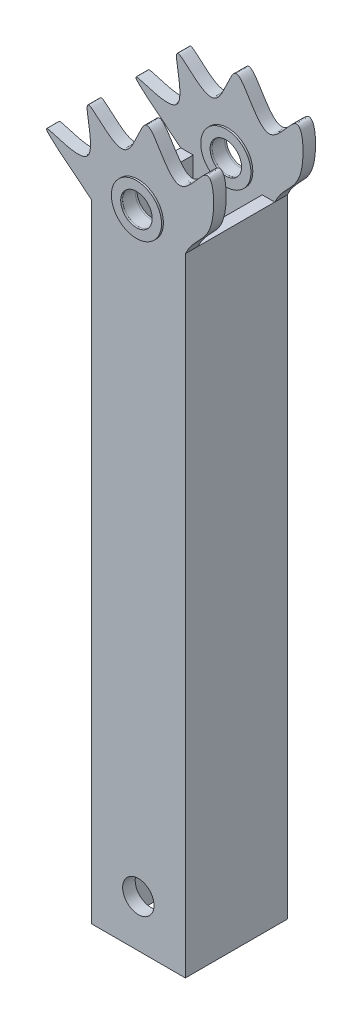
ISO-10303-21;
HEADER;
FILE_DESCRIPTION(('STEP AP214'),'2;1');
FILE_NAME('part.step','',(''),(''),'','','');
FILE_SCHEMA(('AUTOMOTIVE_DESIGN { 1 0 10303 214 1 1 1 1 }'));
ENDSEC;
DATA;
#1=APPLICATION_CONTEXT('core data for automotive mechanical design processes');
#2=APPLICATION_PROTOCOL_DEFINITION('international standard','automotive_design',2000,#1);
#3=PRODUCT_CONTEXT('',#1,'mechanical');
#4=PRODUCT('Part','Part','',(#3));
#5=PRODUCT_RELATED_PRODUCT_CATEGORY('part','',(#4));
#6=PRODUCT_DEFINITION_FORMATION('','',#4);
#7=PRODUCT_DEFINITION_CONTEXT('part definition',#1,'design');
#8=PRODUCT_DEFINITION('design','',#6,#7);
#9=PRODUCT_DEFINITION_SHAPE('','',#8);
#10=(LENGTH_UNIT() NAMED_UNIT(*) SI_UNIT(.MILLI.,.METRE.));
#11=(NAMED_UNIT(*) PLANE_ANGLE_UNIT() SI_UNIT($,.RADIAN.));
#12=(NAMED_UNIT(*) SI_UNIT($,.STERADIAN.) SOLID_ANGLE_UNIT());
#13=UNCERTAINTY_MEASURE_WITH_UNIT(LENGTH_MEASURE(1.E-05),#10,'distance_accuracy_value','');
#14=(GEOMETRIC_REPRESENTATION_CONTEXT(3) GLOBAL_UNCERTAINTY_ASSIGNED_CONTEXT((#13)) GLOBAL_UNIT_ASSIGNED_CONTEXT((#10,
#11,#12)) REPRESENTATION_CONTEXT('',''));
#15=CARTESIAN_POINT('',(0.,0.,0.));
#16=DIRECTION('',(0.,0.,1.));
#17=DIRECTION('',(1.,0.,0.));
#18=AXIS2_PLACEMENT_3D('',#15,#16,#17);
#19=CARTESIAN_POINT('',(0.,0.,-41.275));
#20=DIRECTION('',(0.,0.,1.));
#21=DIRECTION('',(-1.,0.,0.));
#22=AXIS2_PLACEMENT_3D('',#19,#20,#21);
#23=PLANE('',#22);
#24=CARTESIAN_POINT('',(0.,133.35,-41.275));
#25=DIRECTION('',(0.,0.,1.));
#26=DIRECTION('',(1.,0.,0.));
#27=AXIS2_PLACEMENT_3D('',#24,#25,#26);
#28=CIRCLE('',#27,6.34999999999999);
#29=CARTESIAN_POINT('',(6.34999999999998,133.35,-41.275));
#30=VERTEX_POINT('',#29);
#31=EDGE_CURVE('E165',#30,#30,#28,.T.);
#32=ORIENTED_EDGE('',*,*,#31,.T.);
#33=EDGE_LOOP('',(#32));
#34=FACE_BOUND('',#33,.T.);
#35=CARTESIAN_POINT('',(0.,133.35,-41.275));
#36=DIRECTION('',(0.,0.,-1.));
#37=DIRECTION('',(-1.,0.,0.));
#38=AXIS2_PLACEMENT_3D('',#35,#36,#37);
#39=CIRCLE('',#38,6.3754);
#40=CARTESIAN_POINT('',(-6.3754,133.35,-41.275));
#41=VERTEX_POINT('',#40);
#42=EDGE_CURVE('E294',#41,#41,#39,.T.);
#43=ORIENTED_EDGE('',*,*,#42,.T.);
#44=EDGE_LOOP('',(#43));
#45=FACE_BOUND('',#44,.T.);
#46=ADVANCED_FACE('F34',(#34,#45),#23,.F.);
#47=CARTESIAN_POINT('',(13.97,-127.,-36.195));
#48=DIRECTION('',(0.,0.,1.));
#49=DIRECTION('',(1.,0.,0.));
#50=AXIS2_PLACEMENT_3D('',#47,#48,#49);
#51=PLANE('',#50);
#52=CARTESIAN_POINT('',(0.,133.35,-36.195));
#53=DIRECTION('',(0.,0.,1.));
#54=DIRECTION('',(1.,0.,0.));
#55=AXIS2_PLACEMENT_3D('',#52,#53,#54);
#56=CIRCLE('',#55,6.34999999999999);
#57=CARTESIAN_POINT('',(6.34999999999998,133.35,-36.195));
#58=VERTEX_POINT('',#57);
#59=EDGE_CURVE('E162',#58,#58,#56,.F.);
#60=ORIENTED_EDGE('',*,*,#59,.T.);
#61=EDGE_LOOP('',(#60));
#62=FACE_BOUND('',#61,.T.);
#63=CARTESIAN_POINT('',(0.,133.35,-36.195));
#64=DIRECTION('',(0.,0.,1.));
#65=DIRECTION('',(1.,0.,0.));
#66=AXIS2_PLACEMENT_3D('',#63,#64,#65);
#67=CIRCLE('',#66,6.3754);
#68=CARTESIAN_POINT('',(6.37539999999999,133.35,-36.195));
#69=VERTEX_POINT('',#68);
#70=EDGE_CURVE('E42',#69,#69,#67,.F.);
#71=ORIENTED_EDGE('',*,*,#70,.F.);
#72=EDGE_LOOP('',(#71));
#73=FACE_BOUND('',#72,.T.);
#74=ADVANCED_FACE('F180',(#62,#73),#51,.T.);
#75=CARTESIAN_POINT('',(0.,0.,0.));
#76=DIRECTION('',(0.,0.,-1.));
#77=DIRECTION('',(-1.,0.,0.));
#78=AXIS2_PLACEMENT_3D('',#75,#76,#77);
#79=PLANE('',#78);
#80=CARTESIAN_POINT('',(0.,133.35,0.));
#81=DIRECTION('',(0.,0.,1.));
#82=DIRECTION('',(1.,0.,0.));
#83=AXIS2_PLACEMENT_3D('',#80,#81,#82);
#84=CIRCLE('',#83,6.34999999999999);
#85=CARTESIAN_POINT('',(6.34999999999998,133.35,0.));
#86=VERTEX_POINT('',#85);
#87=EDGE_CURVE('E157',#86,#86,#84,.T.);
#88=ORIENTED_EDGE('',*,*,#87,.F.);
#89=EDGE_LOOP('',(#88));
#90=FACE_BOUND('',#89,.T.);
#91=CARTESIAN_POINT('',(0.,133.35,0.));
#92=DIRECTION('',(0.,0.,1.));
#93=DIRECTION('',(1.,0.,0.));
#94=AXIS2_PLACEMENT_3D('',#91,#92,#93);
#95=CIRCLE('',#94,6.3754);
#96=CARTESIAN_POINT('',(6.37539999999999,133.35,0.));
#97=VERTEX_POINT('',#96);
#98=EDGE_CURVE('E308',#97,#97,#95,.T.);
#99=ORIENTED_EDGE('',*,*,#98,.T.);
#100=EDGE_LOOP('',(#99));
#101=FACE_BOUND('',#100,.T.);
#102=ADVANCED_FACE('F182',(#90,#101),#79,.F.);
#103=CARTESIAN_POINT('',(13.97,-127.,-5.08));
#104=DIRECTION('',(0.,0.,1.));
#105=DIRECTION('',(1.,0.,0.));
#106=AXIS2_PLACEMENT_3D('',#103,#104,#105);
#107=PLANE('',#106);
#108=CARTESIAN_POINT('',(0.,133.35,-5.08));
#109=DIRECTION('',(0.,0.,1.));
#110=DIRECTION('',(1.,0.,0.));
#111=AXIS2_PLACEMENT_3D('',#108,#109,#110);
#112=CIRCLE('',#111,6.34999999999999);
#113=CARTESIAN_POINT('',(6.34999999999998,133.35,-5.08));
#114=VERTEX_POINT('',#113);
#115=EDGE_CURVE('E153',#114,#114,#112,.T.);
#116=ORIENTED_EDGE('',*,*,#115,.T.);
#117=EDGE_LOOP('',(#116));
#118=FACE_BOUND('',#117,.T.);
#119=CARTESIAN_POINT('',(0.,133.35,-5.08));
#120=DIRECTION('',(0.,0.,-1.));
#121=DIRECTION('',(-1.,0.,0.));
#122=AXIS2_PLACEMENT_3D('',#119,#120,#121);
#123=CIRCLE('',#122,6.3754);
#124=CARTESIAN_POINT('',(-6.3754,133.35,-5.08));
#125=VERTEX_POINT('',#124);
#126=EDGE_CURVE('E318',#125,#125,#123,.T.);
#127=ORIENTED_EDGE('',*,*,#126,.T.);
#128=EDGE_LOOP('',(#127));
#129=FACE_BOUND('',#128,.T.);
#130=ADVANCED_FACE('F189',(#118,#129),#107,.F.);
#131=CARTESIAN_POINT('',(-19.05,127.,-20.6375));
#132=DIRECTION('',(0.,1.,0.));
#133=DIRECTION('',(0.,0.,1.));
#134=AXIS2_PLACEMENT_3D('',#131,#132,#133);
#135=PLANE('',#134);
#136=DIRECTION('',(0.,0.,1.));
#137=VECTOR('',#136,1.);
#138=CARTESIAN_POINT('',(19.05,127.,-20.6375));
#139=LINE('',#138,#137);
#140=CARTESIAN_POINT('',(19.05,127.,-36.195));
#141=VERTEX_POINT('',#140);
#142=CARTESIAN_POINT('',(19.05,127.,-5.08));
#143=VERTEX_POINT('',#142);
#144=EDGE_CURVE('E49',#141,#143,#139,.T.);
#145=ORIENTED_EDGE('',*,*,#144,.F.);
#146=DIRECTION('',(-1.,0.,0.));
#147=VECTOR('',#146,1.);
#148=CARTESIAN_POINT('',(-19.05,127.,-36.195));
#149=LINE('',#148,#147);
#150=CARTESIAN_POINT('',(13.97,127.,-36.195));
#151=VERTEX_POINT('',#150);
#152=EDGE_CURVE('E134',#141,#151,#149,.T.);
#153=ORIENTED_EDGE('',*,*,#152,.T.);
#154=DIRECTION('',(0.,0.,-1.));
#155=VECTOR('',#154,1.);
#156=CARTESIAN_POINT('',(13.97,127.,-20.6375));
#157=LINE('',#156,#155);
#158=CARTESIAN_POINT('',(13.97,127.,-5.08));
#159=VERTEX_POINT('',#158);
#160=EDGE_CURVE('E361',#159,#151,#157,.T.);
#161=ORIENTED_EDGE('',*,*,#160,.F.);
#162=DIRECTION('',(1.,0.,0.));
#163=VECTOR('',#162,1.);
#164=CARTESIAN_POINT('',(-19.05,127.,-5.08));
#165=LINE('',#164,#163);
#166=EDGE_CURVE('E387',#159,#143,#165,.T.);
#167=ORIENTED_EDGE('',*,*,#166,.T.);
#168=EDGE_LOOP('',(#145,#153,#161,#167));
#169=FACE_BOUND('',#168,.T.);
#170=ADVANCED_FACE('F325',(#169),#135,.T.);
#171=DIRECTION('',(0.,0.,1.));
#172=VECTOR('',#171,1.);
#173=CARTESIAN_POINT('',(-13.97,127.,-5.08));
#174=LINE('',#173,#172);
#175=CARTESIAN_POINT('',(-13.97,127.,-36.195));
#176=VERTEX_POINT('',#175);
#177=CARTESIAN_POINT('',(-13.97,127.,-5.08));
#178=VERTEX_POINT('',#177);
#179=EDGE_CURVE('E130',#176,#178,#174,.T.);
#180=ORIENTED_EDGE('',*,*,#179,.F.);
#181=CARTESIAN_POINT('',(-19.05,127.,-36.195));
#182=VERTEX_POINT('',#181);
#183=EDGE_CURVE('E126',#176,#182,#149,.T.);
#184=ORIENTED_EDGE('',*,*,#183,.T.);
#185=DIRECTION('',(0.,0.,1.));
#186=VECTOR('',#185,1.);
#187=CARTESIAN_POINT('',(-19.05,127.,-20.6375));
#188=LINE('',#187,#186);
#189=CARTESIAN_POINT('',(-19.05,127.,-5.08));
#190=VERTEX_POINT('',#189);
#191=EDGE_CURVE('E111',#182,#190,#188,.T.);
#192=ORIENTED_EDGE('',*,*,#191,.T.);
#193=EDGE_CURVE('E352',#190,#178,#165,.T.);
#194=ORIENTED_EDGE('',*,*,#193,.T.);
#195=EDGE_LOOP('',(#180,#184,#192,#194));
#196=FACE_BOUND('',#195,.T.);
#197=ADVANCED_FACE('F128',(#196),#135,.T.);
#198=CARTESIAN_POINT('',(-19.05,-127.,-20.6375));
#199=DIRECTION('',(0.,-1.,0.));
#200=DIRECTION('',(0.,0.,-1.));
#201=AXIS2_PLACEMENT_3D('',#198,#199,#200);
#202=PLANE('',#201);
#203=DIRECTION('',(1.,0.,0.));
#204=VECTOR('',#203,1.);
#205=CARTESIAN_POINT('',(13.97,-127.,-36.195));
#206=LINE('',#205,#204);
#207=CARTESIAN_POINT('',(-13.97,-127.,-36.195));
#208=VERTEX_POINT('',#207);
#209=CARTESIAN_POINT('',(13.97,-127.,-36.195));
#210=VERTEX_POINT('',#209);
#211=EDGE_CURVE('E398',#208,#210,#206,.T.);
#212=ORIENTED_EDGE('',*,*,#211,.F.);
#213=DIRECTION('',(0.,0.,1.));
#214=VECTOR('',#213,1.);
#215=CARTESIAN_POINT('',(-13.97,-127.,-5.08));
#216=LINE('',#215,#214);
#217=CARTESIAN_POINT('',(-13.97,-127.,-5.08));
#218=VERTEX_POINT('',#217);
#219=EDGE_CURVE('E371',#208,#218,#216,.T.);
#220=ORIENTED_EDGE('',*,*,#219,.T.);
#221=DIRECTION('',(1.,0.,0.));
#222=VECTOR('',#221,1.);
#223=CARTESIAN_POINT('',(13.97,-127.,-5.08));
#224=LINE('',#223,#222);
#225=CARTESIAN_POINT('',(13.97,-127.,-5.08));
#226=VERTEX_POINT('',#225);
#227=EDGE_CURVE('E355',#218,#226,#224,.T.);
#228=ORIENTED_EDGE('',*,*,#227,.T.);
#229=DIRECTION('',(0.,0.,-1.));
#230=VECTOR('',#229,1.);
#231=CARTESIAN_POINT('',(13.97,-127.,-20.6375));
#232=LINE('',#231,#230);
#233=EDGE_CURVE('E363',#226,#210,#232,.T.);
#234=ORIENTED_EDGE('',*,*,#233,.T.);
#235=EDGE_LOOP('',(#212,#220,#228,#234));
#236=FACE_BOUND('',#235,.T.);
#237=DIRECTION('',(1.,0.,0.));
#238=VECTOR('',#237,1.);
#239=CARTESIAN_POINT('',(-19.05,-127.,0.));
#240=LINE('',#239,#238);
#241=CARTESIAN_POINT('',(-19.05,-127.,0.));
#242=VERTEX_POINT('',#241);
#243=CARTESIAN_POINT('',(19.05,-127.,0.));
#244=VERTEX_POINT('',#243);
#245=EDGE_CURVE('E377',#242,#244,#240,.T.);
#246=ORIENTED_EDGE('',*,*,#245,.F.);
#247=DIRECTION('',(0.,0.,1.));
#248=VECTOR('',#247,1.);
#249=CARTESIAN_POINT('',(-19.05,-127.,-20.6375));
#250=LINE('',#249,#248);
#251=CARTESIAN_POINT('',(-19.05,-127.,-41.275));
#252=VERTEX_POINT('',#251);
#253=EDGE_CURVE('E148',#252,#242,#250,.T.);
#254=ORIENTED_EDGE('',*,*,#253,.F.);
#255=DIRECTION('',(1.,0.,0.));
#256=VECTOR('',#255,1.);
#257=CARTESIAN_POINT('',(-19.05,-127.,-41.275));
#258=LINE('',#257,#256);
#259=CARTESIAN_POINT('',(19.05,-127.,-41.275));
#260=VERTEX_POINT('',#259);
#261=EDGE_CURVE('E407',#252,#260,#258,.T.);
#262=ORIENTED_EDGE('',*,*,#261,.T.);
#263=DIRECTION('',(0.,0.,1.));
#264=VECTOR('',#263,1.);
#265=CARTESIAN_POINT('',(19.05,-127.,-20.6375));
#266=LINE('',#265,#264);
#267=EDGE_CURVE('E57',#260,#244,#266,.T.);
#268=ORIENTED_EDGE('',*,*,#267,.T.);
#269=EDGE_LOOP('',(#246,#254,#262,#268));
#270=FACE_BOUND('',#269,.T.);
#271=ADVANCED_FACE('F396',(#236,#270),#202,.T.);
#272=CARTESIAN_POINT('',(19.05,-127.,-20.6375));
#273=DIRECTION('',(1.,0.,0.));
#274=DIRECTION('',(0.,0.,-1.));
#275=AXIS2_PLACEMENT_3D('',#272,#273,#274);
#276=PLANE('',#275);
#277=CARTESIAN_POINT('',(19.05,127.,-41.275));
#278=VERTEX_POINT('',#277);
#279=EDGE_CURVE('E123',#278,#141,#139,.T.);
#280=ORIENTED_EDGE('',*,*,#279,.T.);
#281=ORIENTED_EDGE('',*,*,#144,.T.);
#282=DIRECTION('',(0.,0.,1.));
#283=VECTOR('',#282,1.);
#284=CARTESIAN_POINT('',(19.05,127.,-5.08));
#285=LINE('',#284,#283);
#286=CARTESIAN_POINT('',(19.05,127.,0.));
#287=VERTEX_POINT('',#286);
#288=EDGE_CURVE('E383',#143,#287,#285,.T.);
#289=ORIENTED_EDGE('',*,*,#288,.T.);
#290=DIRECTION('',(0.,1.,0.));
#291=VECTOR('',#290,1.);
#292=CARTESIAN_POINT('',(19.05,-127.,0.));
#293=LINE('',#292,#291);
#294=EDGE_CURVE('E357',#244,#287,#293,.T.);
#295=ORIENTED_EDGE('',*,*,#294,.F.);
#296=ORIENTED_EDGE('',*,*,#267,.F.);
#297=DIRECTION('',(0.,1.,0.));
#298=VECTOR('',#297,1.);
#299=CARTESIAN_POINT('',(19.05,-127.,-41.275));
#300=LINE('',#299,#298);
#301=EDGE_CURVE('E402',#260,#278,#300,.T.);
#302=ORIENTED_EDGE('',*,*,#301,.T.);
#303=EDGE_LOOP('',(#280,#281,#289,#295,#296,#302));
#304=FACE_BOUND('',#303,.T.);
#305=ADVANCED_FACE('F36',(#304),#276,.T.);
#306=CARTESIAN_POINT('',(-19.05,-127.,-20.6375));
#307=DIRECTION('',(-1.,0.,0.));
#308=DIRECTION('',(0.,0.,1.));
#309=AXIS2_PLACEMENT_3D('',#306,#307,#308);
#310=PLANE('',#309);
#311=ORIENTED_EDGE('',*,*,#253,.T.);
#312=DIRECTION('',(0.,-1.,0.));
#313=VECTOR('',#312,1.);
#314=CARTESIAN_POINT('',(-19.05,-127.,0.));
#315=LINE('',#314,#313);
#316=CARTESIAN_POINT('',(-19.05,127.,0.));
#317=VERTEX_POINT('',#316);
#318=EDGE_CURVE('E374',#317,#242,#315,.T.);
#319=ORIENTED_EDGE('',*,*,#318,.F.);
#320=DIRECTION('',(0.,0.,1.));
#321=VECTOR('',#320,1.);
#322=CARTESIAN_POINT('',(-19.05,127.,-5.08));
#323=LINE('',#322,#321);
#324=EDGE_CURVE('E120',#190,#317,#323,.T.);
#325=ORIENTED_EDGE('',*,*,#324,.F.);
#326=ORIENTED_EDGE('',*,*,#191,.F.);
#327=CARTESIAN_POINT('',(-19.05,127.,-41.275));
#328=VERTEX_POINT('',#327);
#329=EDGE_CURVE('E116',#328,#182,#188,.T.);
#330=ORIENTED_EDGE('',*,*,#329,.F.);
#331=DIRECTION('',(0.,-1.,0.));
#332=VECTOR('',#331,1.);
#333=CARTESIAN_POINT('',(-19.05,-127.,-41.275));
#334=LINE('',#333,#332);
#335=EDGE_CURVE('E409',#328,#252,#334,.T.);
#336=ORIENTED_EDGE('',*,*,#335,.T.);
#337=EDGE_LOOP('',(#311,#319,#325,#326,#330,#336));
#338=FACE_BOUND('',#337,.T.);
#339=ADVANCED_FACE('F113',(#338),#310,.T.);
#340=CARTESIAN_POINT('',(0.,133.35,0.));
#341=DIRECTION('',(0.,0.,-1.));
#342=DIRECTION('',(-1.,0.,0.));
#343=AXIS2_PLACEMENT_3D('',#340,#341,#342);
#344=CIRCLE('',#343,10.16);
#345=CARTESIAN_POINT('',(-10.16,133.35,0.));
#346=VERTEX_POINT('',#345);
#347=EDGE_CURVE('E173',#346,#346,#344,.F.);
#348=ORIENTED_EDGE('',*,*,#347,.F.);
#349=EDGE_LOOP('',(#348));
#350=FACE_BOUND('',#349,.T.);
#351=CARTESIAN_POINT('',(0.,-107.95,0.));
#352=DIRECTION('',(0.,0.,1.));
#353=DIRECTION('',(1.,0.,0.));
#354=AXIS2_PLACEMENT_3D('',#351,#352,#353);
#355=CIRCLE('',#354,6.34999999999999);
#356=CARTESIAN_POINT('',(6.34999999999999,-107.95,0.));
#357=VERTEX_POINT('',#356);
#358=EDGE_CURVE('E161',#357,#357,#355,.T.);
#359=ORIENTED_EDGE('',*,*,#358,.F.);
#360=EDGE_LOOP('',(#359));
#361=FACE_BOUND('',#360,.T.);
#362=ORIENTED_EDGE('',*,*,#294,.T.);
#363=CARTESIAN_POINT('',(19.05,127.,0.));
#364=CARTESIAN_POINT('',(22.264682919048,133.908235623245,0.));
#365=CARTESIAN_POINT('',(31.8390429124705,136.047979139782,0.));
#366=CARTESIAN_POINT('',(30.4669546194043,168.517170498395,0.));
#367=CARTESIAN_POINT('',(14.8126421317916,138.429098192106,0.));
#368=CARTESIAN_POINT('',(2.77585165558547,177.747781305733,0.));
#369=CARTESIAN_POINT('',(-3.38458125886248,140.10268819999,0.));
#370=CARTESIAN_POINT('',(-26.7121094582346,171.110128284464,0.));
#371=CARTESIAN_POINT('',(-8.76511536606956,122.45594985264,0.));
#372=CARTESIAN_POINT('',(-56.0753152623224,156.2498503925,0.));
#373=CARTESIAN_POINT('',(-19.05,127.,0.));
#374=B_SPLINE_CURVE_WITH_KNOTS('',3,(#363,#364,#365,#366,#367,#368,#369,#370,#371,#372,#373),
.UNSPECIFIED.,.F.,.F.,(4,1,1,1,1,1,1,1,4),(0.,0.117763915592875,0.232815074324997,
0.325131150893916,0.457169313957458,0.564335426334935,0.674077041064471,0.79253575626535,1.),.UNSPECIFIED.);
#375=EDGE_CURVE('E156',#287,#317,#374,.T.);
#376=ORIENTED_EDGE('',*,*,#375,.T.);
#377=ORIENTED_EDGE('',*,*,#318,.T.);
#378=ORIENTED_EDGE('',*,*,#245,.T.);
#379=EDGE_LOOP('',(#362,#376,#377,#378));
#380=FACE_BOUND('',#379,.T.);
#381=ADVANCED_FACE('F192',(#350,#361,#380),#79,.F.);
#382=CARTESIAN_POINT('',(0.,133.35,-5.08));
#383=DIRECTION('',(0.,0.,1.));
#384=DIRECTION('',(1.,0.,0.));
#385=AXIS2_PLACEMENT_3D('',#382,#383,#384);
#386=CIRCLE('',#385,10.16);
#387=CARTESIAN_POINT('',(10.16,133.35,-5.08));
#388=VERTEX_POINT('',#387);
#389=EDGE_CURVE('E170',#388,#388,#386,.F.);
#390=ORIENTED_EDGE('',*,*,#389,.F.);
#391=EDGE_LOOP('',(#390));
#392=FACE_BOUND('',#391,.T.);
#393=CARTESIAN_POINT('',(0.,-107.95,-5.08));
#394=DIRECTION('',(0.,0.,1.));
#395=DIRECTION('',(1.,0.,0.));
#396=AXIS2_PLACEMENT_3D('',#393,#394,#395);
#397=CIRCLE('',#396,6.34999999999999);
#398=CARTESIAN_POINT('',(6.34999999999999,-107.95,-5.08));
#399=VERTEX_POINT('',#398);
#400=EDGE_CURVE('E158',#399,#399,#397,.T.);
#401=ORIENTED_EDGE('',*,*,#400,.T.);
#402=EDGE_LOOP('',(#401));
#403=FACE_BOUND('',#402,.T.);
#404=DIRECTION('',(0.,1.,0.));
#405=VECTOR('',#404,1.);
#406=CARTESIAN_POINT('',(-13.97,-127.,-5.08));
#407=LINE('',#406,#405);
#408=EDGE_CURVE('E350',#218,#178,#407,.T.);
#409=ORIENTED_EDGE('',*,*,#408,.T.);
#410=ORIENTED_EDGE('',*,*,#193,.F.);
#411=CARTESIAN_POINT('',(19.05,127.,-5.08));
#412=CARTESIAN_POINT('',(22.264682919048,133.908235623245,-5.08));
#413=CARTESIAN_POINT('',(31.8390429124705,136.047979139782,-5.08));
#414=CARTESIAN_POINT('',(30.4669546194043,168.517170498395,-5.08));
#415=CARTESIAN_POINT('',(14.8126421317916,138.429098192106,-5.08));
#416=CARTESIAN_POINT('',(2.77585165558547,177.747781305733,-5.08));
#417=CARTESIAN_POINT('',(-3.38458125886248,140.10268819999,-5.08));
#418=CARTESIAN_POINT('',(-26.7121094582346,171.110128284464,-5.08));
#419=CARTESIAN_POINT('',(-8.76511536606956,122.45594985264,-5.08));
#420=CARTESIAN_POINT('',(-56.0753152623224,156.2498503925,-5.08));
#421=CARTESIAN_POINT('',(-19.05,127.,-5.08));
#422=B_SPLINE_CURVE_WITH_KNOTS('',3,(#411,#412,#413,#414,#415,#416,#417,#418,#419,#420,#421),
.UNSPECIFIED.,.F.,.F.,(4,1,1,1,1,1,1,1,4),(0.,0.117763915592875,0.232815074324997,
0.325131150893916,0.457169313957458,0.564335426334935,0.674077041064471,0.79253575626535,1.),.UNSPECIFIED.);
#423=EDGE_CURVE('E386',#143,#190,#422,.T.);
#424=ORIENTED_EDGE('',*,*,#423,.F.);
#425=ORIENTED_EDGE('',*,*,#166,.F.);
#426=DIRECTION('',(0.,1.,0.));
#427=VECTOR('',#426,1.);
#428=CARTESIAN_POINT('',(13.97,-127.,-5.08));
#429=LINE('',#428,#427);
#430=EDGE_CURVE('E358',#226,#159,#429,.T.);
#431=ORIENTED_EDGE('',*,*,#430,.F.);
#432=ORIENTED_EDGE('',*,*,#227,.F.);
#433=EDGE_LOOP('',(#409,#410,#424,#425,#431,#432));
#434=FACE_BOUND('',#433,.T.);
#435=ADVANCED_FACE('F328',(#392,#403,#434),#107,.F.);
#436=CARTESIAN_POINT('',(-13.97,-127.,-5.08));
#437=DIRECTION('',(-1.,0.,0.));
#438=DIRECTION('',(0.,0.,1.));
#439=AXIS2_PLACEMENT_3D('',#436,#437,#438);
#440=PLANE('',#439);
#441=ORIENTED_EDGE('',*,*,#179,.T.);
#442=ORIENTED_EDGE('',*,*,#408,.F.);
#443=ORIENTED_EDGE('',*,*,#219,.F.);
#444=DIRECTION('',(0.,1.,0.));
#445=VECTOR('',#444,1.);
#446=CARTESIAN_POINT('',(-13.97,-127.,-36.195));
#447=LINE('',#446,#445);
#448=EDGE_CURVE('E360',#208,#176,#447,.T.);
#449=ORIENTED_EDGE('',*,*,#448,.T.);
#450=EDGE_LOOP('',(#441,#442,#443,#449));
#451=FACE_BOUND('',#450,.T.);
#452=ADVANCED_FACE('F334',(#451),#440,.F.);
#453=CARTESIAN_POINT('',(13.97,-127.,-20.6375));
#454=DIRECTION('',(1.,0.,0.));
#455=DIRECTION('',(0.,0.,-1.));
#456=AXIS2_PLACEMENT_3D('',#453,#454,#455);
#457=PLANE('',#456);
#458=ORIENTED_EDGE('',*,*,#160,.T.);
#459=DIRECTION('',(0.,1.,0.));
#460=VECTOR('',#459,1.);
#461=CARTESIAN_POINT('',(13.97,-127.,-36.195));
#462=LINE('',#461,#460);
#463=EDGE_CURVE('E400',#210,#151,#462,.T.);
#464=ORIENTED_EDGE('',*,*,#463,.F.);
#465=ORIENTED_EDGE('',*,*,#233,.F.);
#466=ORIENTED_EDGE('',*,*,#430,.T.);
#467=EDGE_LOOP('',(#458,#464,#465,#466));
#468=FACE_BOUND('',#467,.T.);
#469=ADVANCED_FACE('F340',(#468),#457,.F.);
#470=DIRECTION('',(0.,0.,1.));
#471=VECTOR('',#470,1.);
#472=SURFACE_OF_LINEAR_EXTRUSION('',#422,#471);
#473=ORIENTED_EDGE('',*,*,#375,.F.);
#474=ORIENTED_EDGE('',*,*,#288,.F.);
#475=ORIENTED_EDGE('',*,*,#423,.T.);
#476=ORIENTED_EDGE('',*,*,#324,.T.);
#477=EDGE_LOOP('',(#473,#474,#475,#476));
#478=FACE_BOUND('',#477,.T.);
#479=ADVANCED_FACE('F385',(#478),#472,.T.);
#480=CARTESIAN_POINT('',(0.,133.35,-20.6375));
#481=DIRECTION('',(0.,0.,1.));
#482=DIRECTION('',(1.,0.,0.));
#483=AXIS2_PLACEMENT_3D('',#480,#481,#482);
#484=CYLINDRICAL_SURFACE('',#483,6.34999999999999);
#485=ORIENTED_EDGE('',*,*,#87,.T.);
#486=EDGE_LOOP('',(#485));
#487=FACE_BOUND('',#486,.T.);
#488=ORIENTED_EDGE('',*,*,#115,.F.);
#489=EDGE_LOOP('',(#488));
#490=FACE_BOUND('',#489,.T.);
#491=ADVANCED_FACE('F426',(#487,#490),#484,.F.);
#492=CARTESIAN_POINT('',(0.,-107.95,-20.6375));
#493=DIRECTION('',(0.,0.,1.));
#494=DIRECTION('',(1.,0.,0.));
#495=AXIS2_PLACEMENT_3D('',#492,#493,#494);
#496=CYLINDRICAL_SURFACE('',#495,6.34999999999999);
#497=ORIENTED_EDGE('',*,*,#358,.T.);
#498=EDGE_LOOP('',(#497));
#499=FACE_BOUND('',#498,.T.);
#500=ORIENTED_EDGE('',*,*,#400,.F.);
#501=EDGE_LOOP('',(#500));
#502=FACE_BOUND('',#501,.T.);
#503=ADVANCED_FACE('F204',(#499,#502),#496,.F.);
#504=CARTESIAN_POINT('',(0.,133.35,-41.275));
#505=DIRECTION('',(0.,0.,1.));
#506=DIRECTION('',(1.,0.,0.));
#507=AXIS2_PLACEMENT_3D('',#504,#505,#506);
#508=CIRCLE('',#507,10.16);
#509=CARTESIAN_POINT('',(10.16,133.35,-41.275));
#510=VERTEX_POINT('',#509);
#511=EDGE_CURVE('E11',#510,#510,#508,.F.);
#512=ORIENTED_EDGE('',*,*,#511,.F.);
#513=EDGE_LOOP('',(#512));
#514=FACE_BOUND('',#513,.T.);
#515=CARTESIAN_POINT('',(0.,-107.95,-41.275));
#516=DIRECTION('',(0.,0.,1.));
#517=DIRECTION('',(1.,0.,0.));
#518=AXIS2_PLACEMENT_3D('',#515,#516,#517);
#519=CIRCLE('',#518,6.34999999999999);
#520=CARTESIAN_POINT('',(6.34999999999999,-107.95,-41.275));
#521=VERTEX_POINT('',#520);
#522=EDGE_CURVE('E169',#521,#521,#519,.T.);
#523=ORIENTED_EDGE('',*,*,#522,.T.);
#524=EDGE_LOOP('',(#523));
#525=FACE_BOUND('',#524,.T.);
#526=ORIENTED_EDGE('',*,*,#301,.F.);
#527=ORIENTED_EDGE('',*,*,#261,.F.);
#528=ORIENTED_EDGE('',*,*,#335,.F.);
#529=CARTESIAN_POINT('',(19.05,127.,-41.275));
#530=CARTESIAN_POINT('',(22.264682919048,133.908235623245,-41.275));
#531=CARTESIAN_POINT('',(31.8390429124705,136.047979139782,-41.275));
#532=CARTESIAN_POINT('',(30.4669546194043,168.517170498395,-41.275));
#533=CARTESIAN_POINT('',(14.8126421317916,138.429098192106,-41.275));
#534=CARTESIAN_POINT('',(2.77585165558547,177.747781305733,-41.275));
#535=CARTESIAN_POINT('',(-3.38458125886248,140.10268819999,-41.275));
#536=CARTESIAN_POINT('',(-26.7121094582346,171.110128284464,-41.275));
#537=CARTESIAN_POINT('',(-8.76511536606956,122.45594985264,-41.275));
#538=CARTESIAN_POINT('',(-56.0753152623224,156.2498503925,-41.275));
#539=CARTESIAN_POINT('',(-19.05,127.,-41.275));
#540=B_SPLINE_CURVE_WITH_KNOTS('',3,(#529,#530,#531,#532,#533,#534,#535,#536,#537,#538,#539),
.UNSPECIFIED.,.F.,.F.,(4,1,1,1,1,1,1,1,4),(0.,0.117763915592875,0.232815074324997,
0.325131150893916,0.457169313957458,0.564335426334935,0.674077041064471,0.79253575626535,1.),.UNSPECIFIED.);
#541=EDGE_CURVE('E143',#278,#328,#540,.T.);
#542=ORIENTED_EDGE('',*,*,#541,.F.);
#543=EDGE_LOOP('',(#526,#527,#528,#542));
#544=FACE_BOUND('',#543,.T.);
#545=ADVANCED_FACE('F195',(#514,#525,#544),#23,.F.);
#546=CARTESIAN_POINT('',(0.,133.35,-36.195));
#547=DIRECTION('',(0.,0.,1.));
#548=DIRECTION('',(1.,0.,0.));
#549=AXIS2_PLACEMENT_3D('',#546,#547,#548);
#550=CIRCLE('',#549,10.16);
#551=CARTESIAN_POINT('',(10.16,133.35,-36.195));
#552=VERTEX_POINT('',#551);
#553=EDGE_CURVE('E209',#552,#552,#550,.T.);
#554=ORIENTED_EDGE('',*,*,#553,.F.);
#555=EDGE_LOOP('',(#554));
#556=FACE_BOUND('',#555,.T.);
#557=CARTESIAN_POINT('',(0.,-107.95,-36.195));
#558=DIRECTION('',(0.,0.,1.));
#559=DIRECTION('',(1.,0.,0.));
#560=AXIS2_PLACEMENT_3D('',#557,#558,#559);
#561=CIRCLE('',#560,6.34999999999999);
#562=CARTESIAN_POINT('',(6.34999999999999,-107.95,-36.195));
#563=VERTEX_POINT('',#562);
#564=EDGE_CURVE('E166',#563,#563,#561,.F.);
#565=ORIENTED_EDGE('',*,*,#564,.T.);
#566=EDGE_LOOP('',(#565));
#567=FACE_BOUND('',#566,.T.);
#568=ORIENTED_EDGE('',*,*,#463,.T.);
#569=ORIENTED_EDGE('',*,*,#152,.F.);
#570=CARTESIAN_POINT('',(19.05,127.,-36.195));
#571=CARTESIAN_POINT('',(22.264682919048,133.908235623245,-36.195));
#572=CARTESIAN_POINT('',(31.8390429124705,136.047979139782,-36.195));
#573=CARTESIAN_POINT('',(30.4669546194043,168.517170498395,-36.195));
#574=CARTESIAN_POINT('',(14.8126421317916,138.429098192106,-36.195));
#575=CARTESIAN_POINT('',(2.77585165558547,177.747781305733,-36.195));
#576=CARTESIAN_POINT('',(-3.38458125886248,140.10268819999,-36.195));
#577=CARTESIAN_POINT('',(-26.7121094582346,171.110128284464,-36.195));
#578=CARTESIAN_POINT('',(-8.76511536606956,122.45594985264,-36.195));
#579=CARTESIAN_POINT('',(-56.0753152623224,156.2498503925,-36.195));
#580=CARTESIAN_POINT('',(-19.05,127.,-36.195));
#581=B_SPLINE_CURVE_WITH_KNOTS('',3,(#570,#571,#572,#573,#574,#575,#576,#577,#578,#579,#580),
.UNSPECIFIED.,.F.,.F.,(4,1,1,1,1,1,1,1,4),(0.,0.117763915592875,0.232815074324997,
0.325131150893916,0.457169313957458,0.564335426334935,0.674077041064471,0.79253575626535,1.),.UNSPECIFIED.);
#582=EDGE_CURVE('E135',#141,#182,#581,.T.);
#583=ORIENTED_EDGE('',*,*,#582,.T.);
#584=ORIENTED_EDGE('',*,*,#183,.F.);
#585=ORIENTED_EDGE('',*,*,#448,.F.);
#586=ORIENTED_EDGE('',*,*,#211,.T.);
#587=EDGE_LOOP('',(#568,#569,#583,#584,#585,#586));
#588=FACE_BOUND('',#587,.T.);
#589=ADVANCED_FACE('F140',(#556,#567,#588),#51,.T.);
#590=DIRECTION('',(0.,0.,-1.));
#591=VECTOR('',#590,1.);
#592=SURFACE_OF_LINEAR_EXTRUSION('',#581,#591);
#593=ORIENTED_EDGE('',*,*,#541,.T.);
#594=ORIENTED_EDGE('',*,*,#329,.T.);
#595=ORIENTED_EDGE('',*,*,#582,.F.);
#596=ORIENTED_EDGE('',*,*,#279,.F.);
#597=EDGE_LOOP('',(#593,#594,#595,#596));
#598=FACE_BOUND('',#597,.T.);
#599=ADVANCED_FACE('F146',(#598),#592,.F.);
#600=CARTESIAN_POINT('',(0.,133.35,0.));
#601=DIRECTION('',(0.,0.,-1.));
#602=DIRECTION('',(-1.,0.,0.));
#603=AXIS2_PLACEMENT_3D('',#600,#601,#602);
#604=CYLINDRICAL_SURFACE('',#603,6.34999999999999);
#605=ORIENTED_EDGE('',*,*,#59,.F.);
#606=EDGE_LOOP('',(#605));
#607=FACE_BOUND('',#606,.T.);
#608=ORIENTED_EDGE('',*,*,#31,.F.);
#609=EDGE_LOOP('',(#608));
#610=FACE_BOUND('',#609,.T.);
#611=ADVANCED_FACE('F203',(#607,#610),#604,.F.);
#612=CARTESIAN_POINT('',(0.,-107.95,0.));
#613=DIRECTION('',(0.,0.,-1.));
#614=DIRECTION('',(-1.,0.,0.));
#615=AXIS2_PLACEMENT_3D('',#612,#613,#614);
#616=CYLINDRICAL_SURFACE('',#615,6.34999999999999);
#617=ORIENTED_EDGE('',*,*,#564,.F.);
#618=EDGE_LOOP('',(#617));
#619=FACE_BOUND('',#618,.T.);
#620=ORIENTED_EDGE('',*,*,#522,.F.);
#621=EDGE_LOOP('',(#620));
#622=FACE_BOUND('',#621,.T.);
#623=ADVANCED_FACE('F212',(#619,#622),#616,.F.);
#624=CARTESIAN_POINT('',(0.,133.35,-5.842));
#625=DIRECTION('',(0.,0.,-1.));
#626=DIRECTION('',(-1.,0.,0.));
#627=AXIS2_PLACEMENT_3D('',#624,#625,#626);
#628=PLANE('',#627);
#629=CARTESIAN_POINT('',(0.,133.35,-5.842));
#630=DIRECTION('',(0.,0.,-1.));
#631=DIRECTION('',(-1.,0.,0.));
#632=AXIS2_PLACEMENT_3D('',#629,#630,#631);
#633=CIRCLE('',#632,10.16);
#634=CARTESIAN_POINT('',(-10.16,133.35,-5.842));
#635=VERTEX_POINT('',#634);
#636=EDGE_CURVE('E220',#635,#635,#633,.T.);
#637=ORIENTED_EDGE('',*,*,#636,.T.);
#638=EDGE_LOOP('',(#637));
#639=FACE_BOUND('',#638,.T.);
#640=CARTESIAN_POINT('',(0.,133.35,-5.842));
#641=DIRECTION('',(0.,0.,-1.));
#642=DIRECTION('',(-1.,0.,0.));
#643=AXIS2_PLACEMENT_3D('',#640,#641,#642);
#644=CIRCLE('',#643,6.3754);
#645=CARTESIAN_POINT('',(-6.3754,133.35,-5.842));
#646=VERTEX_POINT('',#645);
#647=EDGE_CURVE('E223',#646,#646,#644,.T.);
#648=ORIENTED_EDGE('',*,*,#647,.F.);
#649=EDGE_LOOP('',(#648));
#650=FACE_BOUND('',#649,.T.);
#651=ADVANCED_FACE('F215',(#639,#650),#628,.T.);
#652=CARTESIAN_POINT('',(0.,133.35,-5.842));
#653=DIRECTION('',(0.,0.,1.));
#654=DIRECTION('',(1.,0.,0.));
#655=AXIS2_PLACEMENT_3D('',#652,#653,#654);
#656=CYLINDRICAL_SURFACE('',#655,10.16);
#657=ORIENTED_EDGE('',*,*,#636,.F.);
#658=EDGE_LOOP('',(#657));
#659=FACE_BOUND('',#658,.T.);
#660=ORIENTED_EDGE('',*,*,#389,.T.);
#661=EDGE_LOOP('',(#660));
#662=FACE_BOUND('',#661,.T.);
#663=ADVANCED_FACE('F241',(#659,#662),#656,.T.);
#664=CARTESIAN_POINT('',(0.,133.35,-5.842));
#665=DIRECTION('',(0.,0.,1.));
#666=DIRECTION('',(1.,0.,0.));
#667=AXIS2_PLACEMENT_3D('',#664,#665,#666);
#668=CYLINDRICAL_SURFACE('',#667,6.3754);
#669=ORIENTED_EDGE('',*,*,#647,.T.);
#670=EDGE_LOOP('',(#669));
#671=FACE_BOUND('',#670,.T.);
#672=ORIENTED_EDGE('',*,*,#126,.F.);
#673=EDGE_LOOP('',(#672));
#674=FACE_BOUND('',#673,.T.);
#675=ADVANCED_FACE('F244',(#671,#674),#668,.F.);
#676=CARTESIAN_POINT('',(0.,133.35,0.762));
#677=DIRECTION('',(0.,0.,1.));
#678=DIRECTION('',(1.,0.,0.));
#679=AXIS2_PLACEMENT_3D('',#676,#677,#678);
#680=PLANE('',#679);
#681=CARTESIAN_POINT('',(0.,133.35,0.762));
#682=DIRECTION('',(0.,0.,1.));
#683=DIRECTION('',(1.,0.,0.));
#684=AXIS2_PLACEMENT_3D('',#681,#682,#683);
#685=CIRCLE('',#684,10.16);
#686=CARTESIAN_POINT('',(10.16,133.35,0.762));
#687=VERTEX_POINT('',#686);
#688=EDGE_CURVE('E313',#687,#687,#685,.T.);
#689=ORIENTED_EDGE('',*,*,#688,.T.);
#690=EDGE_LOOP('',(#689));
#691=FACE_BOUND('',#690,.T.);
#692=CARTESIAN_POINT('',(0.,133.35,0.762));
#693=DIRECTION('',(0.,0.,1.));
#694=DIRECTION('',(1.,0.,0.));
#695=AXIS2_PLACEMENT_3D('',#692,#693,#694);
#696=CIRCLE('',#695,6.3754);
#697=CARTESIAN_POINT('',(6.37539999999999,133.35,0.762));
#698=VERTEX_POINT('',#697);
#699=EDGE_CURVE('E310',#698,#698,#696,.T.);
#700=ORIENTED_EDGE('',*,*,#699,.F.);
#701=EDGE_LOOP('',(#700));
#702=FACE_BOUND('',#701,.T.);
#703=ADVANCED_FACE('F251',(#691,#702),#680,.T.);
#704=CARTESIAN_POINT('',(0.,133.35,0.762));
#705=DIRECTION('',(0.,0.,-1.));
#706=DIRECTION('',(-1.,0.,0.));
#707=AXIS2_PLACEMENT_3D('',#704,#705,#706);
#708=CYLINDRICAL_SURFACE('',#707,10.16);
#709=ORIENTED_EDGE('',*,*,#688,.F.);
#710=EDGE_LOOP('',(#709));
#711=FACE_BOUND('',#710,.T.);
#712=ORIENTED_EDGE('',*,*,#347,.T.);
#713=EDGE_LOOP('',(#712));
#714=FACE_BOUND('',#713,.T.);
#715=ADVANCED_FACE('F253',(#711,#714),#708,.T.);
#716=CARTESIAN_POINT('',(0.,133.35,0.762));
#717=DIRECTION('',(0.,0.,-1.));
#718=DIRECTION('',(-1.,0.,0.));
#719=AXIS2_PLACEMENT_3D('',#716,#717,#718);
#720=CYLINDRICAL_SURFACE('',#719,6.3754);
#721=ORIENTED_EDGE('',*,*,#699,.T.);
#722=EDGE_LOOP('',(#721));
#723=FACE_BOUND('',#722,.T.);
#724=ORIENTED_EDGE('',*,*,#98,.F.);
#725=EDGE_LOOP('',(#724));
#726=FACE_BOUND('',#725,.T.);
#727=ADVANCED_FACE('F256',(#723,#726),#720,.F.);
#728=CARTESIAN_POINT('',(0.,133.35,-35.433));
#729=DIRECTION('',(0.,0.,1.));
#730=DIRECTION('',(1.,0.,0.));
#731=AXIS2_PLACEMENT_3D('',#728,#729,#730);
#732=PLANE('',#731);
#733=CARTESIAN_POINT('',(0.,133.35,-35.433));
#734=DIRECTION('',(0.,0.,1.));
#735=DIRECTION('',(1.,0.,0.));
#736=AXIS2_PLACEMENT_3D('',#733,#734,#735);
#737=CIRCLE('',#736,10.16);
#738=CARTESIAN_POINT('',(10.16,133.35,-35.433));
#739=VERTEX_POINT('',#738);
#740=EDGE_CURVE('E305',#739,#739,#737,.T.);
#741=ORIENTED_EDGE('',*,*,#740,.T.);
#742=EDGE_LOOP('',(#741));
#743=FACE_BOUND('',#742,.T.);
#744=CARTESIAN_POINT('',(0.,133.35,-35.433));
#745=DIRECTION('',(0.,0.,1.));
#746=DIRECTION('',(1.,0.,0.));
#747=AXIS2_PLACEMENT_3D('',#744,#745,#746);
#748=CIRCLE('',#747,6.3754);
#749=CARTESIAN_POINT('',(6.37539999999999,133.35,-35.433));
#750=VERTEX_POINT('',#749);
#751=EDGE_CURVE('E302',#750,#750,#748,.T.);
#752=ORIENTED_EDGE('',*,*,#751,.F.);
#753=EDGE_LOOP('',(#752));
#754=FACE_BOUND('',#753,.T.);
#755=ADVANCED_FACE('F263',(#743,#754),#732,.T.);
#756=CARTESIAN_POINT('',(0.,133.35,-35.433));
#757=DIRECTION('',(0.,0.,-1.));
#758=DIRECTION('',(-1.,0.,0.));
#759=AXIS2_PLACEMENT_3D('',#756,#757,#758);
#760=CYLINDRICAL_SURFACE('',#759,10.16);
#761=ORIENTED_EDGE('',*,*,#740,.F.);
#762=EDGE_LOOP('',(#761));
#763=FACE_BOUND('',#762,.T.);
#764=ORIENTED_EDGE('',*,*,#553,.T.);
#765=EDGE_LOOP('',(#764));
#766=FACE_BOUND('',#765,.T.);
#767=ADVANCED_FACE('F265',(#763,#766),#760,.T.);
#768=CARTESIAN_POINT('',(0.,133.35,-35.433));
#769=DIRECTION('',(0.,0.,-1.));
#770=DIRECTION('',(-1.,0.,0.));
#771=AXIS2_PLACEMENT_3D('',#768,#769,#770);
#772=CYLINDRICAL_SURFACE('',#771,6.3754);
#773=ORIENTED_EDGE('',*,*,#751,.T.);
#774=EDGE_LOOP('',(#773));
#775=FACE_BOUND('',#774,.T.);
#776=ORIENTED_EDGE('',*,*,#70,.T.);
#777=EDGE_LOOP('',(#776));
#778=FACE_BOUND('',#777,.T.);
#779=ADVANCED_FACE('F178',(#775,#778),#772,.F.);
#780=CARTESIAN_POINT('',(0.,133.35,-42.037));
#781=DIRECTION('',(0.,0.,-1.));
#782=DIRECTION('',(-1.,0.,0.));
#783=AXIS2_PLACEMENT_3D('',#780,#781,#782);
#784=PLANE('',#783);
#785=CARTESIAN_POINT('',(0.,133.35,-42.037));
#786=DIRECTION('',(0.,0.,-1.));
#787=DIRECTION('',(-1.,0.,0.));
#788=AXIS2_PLACEMENT_3D('',#785,#786,#787);
#789=CIRCLE('',#788,10.16);
#790=CARTESIAN_POINT('',(-10.16,133.35,-42.037));
#791=VERTEX_POINT('',#790);
#792=EDGE_CURVE('E297',#791,#791,#789,.T.);
#793=ORIENTED_EDGE('',*,*,#792,.T.);
#794=EDGE_LOOP('',(#793));
#795=FACE_BOUND('',#794,.T.);
#796=CARTESIAN_POINT('',(0.,133.35,-42.037));
#797=DIRECTION('',(0.,0.,-1.));
#798=DIRECTION('',(-1.,0.,0.));
#799=AXIS2_PLACEMENT_3D('',#796,#797,#798);
#800=CIRCLE('',#799,6.3754);
#801=CARTESIAN_POINT('',(-6.3754,133.35,-42.037));
#802=VERTEX_POINT('',#801);
#803=EDGE_CURVE('E291',#802,#802,#800,.T.);
#804=ORIENTED_EDGE('',*,*,#803,.F.);
#805=EDGE_LOOP('',(#804));
#806=FACE_BOUND('',#805,.T.);
#807=ADVANCED_FACE('F274',(#795,#806),#784,.T.);
#808=CARTESIAN_POINT('',(0.,133.35,-42.037));
#809=DIRECTION('',(0.,0.,1.));
#810=DIRECTION('',(1.,0.,0.));
#811=AXIS2_PLACEMENT_3D('',#808,#809,#810);
#812=CYLINDRICAL_SURFACE('',#811,10.16);
#813=ORIENTED_EDGE('',*,*,#792,.F.);
#814=EDGE_LOOP('',(#813));
#815=FACE_BOUND('',#814,.T.);
#816=ORIENTED_EDGE('',*,*,#511,.T.);
#817=EDGE_LOOP('',(#816));
#818=FACE_BOUND('',#817,.T.);
#819=ADVANCED_FACE('F276',(#815,#818),#812,.T.);
#820=CARTESIAN_POINT('',(0.,133.35,-42.037));
#821=DIRECTION('',(0.,0.,1.));
#822=DIRECTION('',(1.,0.,0.));
#823=AXIS2_PLACEMENT_3D('',#820,#821,#822);
#824=CYLINDRICAL_SURFACE('',#823,6.3754);
#825=ORIENTED_EDGE('',*,*,#803,.T.);
#826=EDGE_LOOP('',(#825));
#827=FACE_BOUND('',#826,.T.);
#828=ORIENTED_EDGE('',*,*,#42,.F.);
#829=EDGE_LOOP('',(#828));
#830=FACE_BOUND('',#829,.T.);
#831=ADVANCED_FACE('F279',(#827,#830),#824,.F.);
#832=CLOSED_SHELL('',(#46,#74,#102,#130,#170,#197,#271,#305,#339,#381,#435,#452,#469,#479,#491,
#503,#545,#589,#599,#611,#623,#651,#663,#675,#703,#715,#727,#755,#767,#779,#807,#819,#831));
#833=MANIFOLD_SOLID_BREP('B2',#832);
#834=ADVANCED_BREP_SHAPE_REPRESENTATION('',(#18,#833),#14);
#835=SHAPE_DEFINITION_REPRESENTATION(#9,#834);
ENDSEC;
END-ISO-10303-21;
